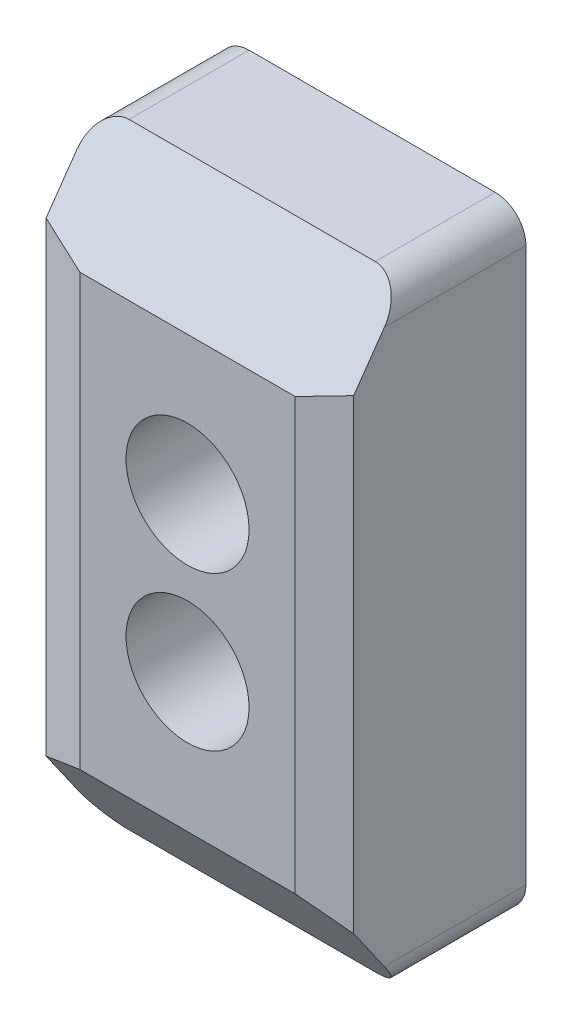
ISO-10303-21;
HEADER;
FILE_DESCRIPTION(('STEP AP214'),'2;1');
FILE_NAME('part.step','',(''),(''),'','','');
FILE_SCHEMA(('AUTOMOTIVE_DESIGN { 1 0 10303 214 1 1 1 1 }'));
ENDSEC;
DATA;
#1=APPLICATION_CONTEXT('core data for automotive mechanical design processes');
#2=APPLICATION_PROTOCOL_DEFINITION('international standard','automotive_design',2000,#1);
#3=PRODUCT_CONTEXT('',#1,'mechanical');
#4=PRODUCT('Part','Part','',(#3));
#5=PRODUCT_RELATED_PRODUCT_CATEGORY('part','',(#4));
#6=PRODUCT_DEFINITION_FORMATION('','',#4);
#7=PRODUCT_DEFINITION_CONTEXT('part definition',#1,'design');
#8=PRODUCT_DEFINITION('design','',#6,#7);
#9=PRODUCT_DEFINITION_SHAPE('','',#8);
#10=(LENGTH_UNIT() NAMED_UNIT(*) SI_UNIT(.MILLI.,.METRE.));
#11=(NAMED_UNIT(*) PLANE_ANGLE_UNIT() SI_UNIT($,.RADIAN.));
#12=(NAMED_UNIT(*) SI_UNIT($,.STERADIAN.) SOLID_ANGLE_UNIT());
#13=UNCERTAINTY_MEASURE_WITH_UNIT(LENGTH_MEASURE(1.E-05),#10,'distance_accuracy_value','');
#14=(GEOMETRIC_REPRESENTATION_CONTEXT(3) GLOBAL_UNCERTAINTY_ASSIGNED_CONTEXT((#13)) GLOBAL_UNIT_ASSIGNED_CONTEXT((#10,
#11,#12)) REPRESENTATION_CONTEXT('',''));
#15=CARTESIAN_POINT('',(0.,0.,0.));
#16=DIRECTION('',(0.,0.,1.));
#17=DIRECTION('',(1.,0.,0.));
#18=AXIS2_PLACEMENT_3D('',#15,#16,#17);
#19=CARTESIAN_POINT('',(0.,0.,12.));
#20=DIRECTION('',(0.,0.,-1.));
#21=DIRECTION('',(-1.,0.,0.));
#22=AXIS2_PLACEMENT_3D('',#19,#20,#21);
#23=PLANE('',#22);
#24=CARTESIAN_POINT('',(0.,5.,12.));
#25=DIRECTION('',(0.,0.,1.));
#26=DIRECTION('',(1.,0.,0.));
#27=AXIS2_PLACEMENT_3D('',#24,#25,#26);
#28=CIRCLE('',#27,4.);
#29=CARTESIAN_POINT('',(4.,5.,12.));
#30=VERTEX_POINT('',#29);
#31=EDGE_CURVE('E253',#30,#30,#28,.T.);
#32=ORIENTED_EDGE('',*,*,#31,.F.);
#33=EDGE_LOOP('',(#32));
#34=FACE_BOUND('',#33,.T.);
#35=CARTESIAN_POINT('',(0.,-5.,12.));
#36=DIRECTION('',(0.,0.,1.));
#37=DIRECTION('',(1.,0.,0.));
#38=AXIS2_PLACEMENT_3D('',#35,#36,#37);
#39=CIRCLE('',#38,4.);
#40=CARTESIAN_POINT('',(4.,-5.,12.));
#41=VERTEX_POINT('',#40);
#42=EDGE_CURVE('E250',#41,#41,#39,.T.);
#43=ORIENTED_EDGE('',*,*,#42,.F.);
#44=EDGE_LOOP('',(#43));
#45=FACE_BOUND('',#44,.T.);
#46=DIRECTION('',(0.,-1.,0.));
#47=VECTOR('',#46,1.);
#48=CARTESIAN_POINT('',(-6.99999999999997,0.,12.));
#49=LINE('',#48,#47);
#50=CARTESIAN_POINT('',(-6.99999999999997,14.,12.));
#51=VERTEX_POINT('',#50);
#52=CARTESIAN_POINT('',(-6.99999999999997,-14.,12.));
#53=VERTEX_POINT('',#52);
#54=EDGE_CURVE('E151',#51,#53,#49,.T.);
#55=ORIENTED_EDGE('',*,*,#54,.T.);
#56=DIRECTION('',(1.,0.,0.));
#57=VECTOR('',#56,1.);
#58=CARTESIAN_POINT('',(0.,-14.,12.));
#59=LINE('',#58,#57);
#60=CARTESIAN_POINT('',(6.99999999999996,-14.,12.));
#61=VERTEX_POINT('',#60);
#62=EDGE_CURVE('E134',#53,#61,#59,.T.);
#63=ORIENTED_EDGE('',*,*,#62,.T.);
#64=DIRECTION('',(0.,1.,0.));
#65=VECTOR('',#64,1.);
#66=CARTESIAN_POINT('',(6.99999999999996,0.,12.));
#67=LINE('',#66,#65);
#68=CARTESIAN_POINT('',(6.99999999999996,14.,12.));
#69=VERTEX_POINT('',#68);
#70=EDGE_CURVE('E148',#61,#69,#67,.T.);
#71=ORIENTED_EDGE('',*,*,#70,.T.);
#72=DIRECTION('',(-1.,0.,0.));
#73=VECTOR('',#72,1.);
#74=CARTESIAN_POINT('',(0.,14.,12.));
#75=LINE('',#74,#73);
#76=EDGE_CURVE('E152',#69,#51,#75,.T.);
#77=ORIENTED_EDGE('',*,*,#76,.T.);
#78=EDGE_LOOP('',(#55,#63,#71,#77));
#79=FACE_BOUND('',#78,.T.);
#80=ADVANCED_FACE('F42',(#34,#45,#79),#23,.F.);
#81=CARTESIAN_POINT('',(0.,0.,0.));
#82=DIRECTION('',(0.,0.,-1.));
#83=DIRECTION('',(-1.,0.,0.));
#84=AXIS2_PLACEMENT_3D('',#81,#82,#83);
#85=PLANE('',#84);
#86=CARTESIAN_POINT('',(0.,-5.,0.));
#87=DIRECTION('',(0.,0.,1.));
#88=DIRECTION('',(1.,0.,0.));
#89=AXIS2_PLACEMENT_3D('',#86,#87,#88);
#90=CIRCLE('',#89,2.15);
#91=CARTESIAN_POINT('',(2.15,-5.,0.));
#92=VERTEX_POINT('',#91);
#93=EDGE_CURVE('E245',#92,#92,#90,.T.);
#94=ORIENTED_EDGE('',*,*,#93,.T.);
#95=EDGE_LOOP('',(#94));
#96=FACE_BOUND('',#95,.T.);
#97=DIRECTION('',(0.,-1.,0.));
#98=VECTOR('',#97,1.);
#99=CARTESIAN_POINT('',(-10.,-20.,0.));
#100=LINE('',#99,#98);
#101=CARTESIAN_POINT('',(-10.,18.,0.));
#102=VERTEX_POINT('',#101);
#103=CARTESIAN_POINT('',(-10.,-18.,0.));
#104=VERTEX_POINT('',#103);
#105=EDGE_CURVE('E237',#102,#104,#100,.T.);
#106=ORIENTED_EDGE('',*,*,#105,.F.);
#107=CARTESIAN_POINT('',(-8.,18.,0.));
#108=DIRECTION('',(0.,0.,-1.));
#109=DIRECTION('',(-1.,0.,0.));
#110=AXIS2_PLACEMENT_3D('',#107,#108,#109);
#111=CIRCLE('',#110,2.);
#112=CARTESIAN_POINT('',(-8.,20.,0.));
#113=VERTEX_POINT('',#112);
#114=EDGE_CURVE('E203',#102,#113,#111,.T.);
#115=ORIENTED_EDGE('',*,*,#114,.T.);
#116=DIRECTION('',(-1.,0.,0.));
#117=VECTOR('',#116,1.);
#118=CARTESIAN_POINT('',(-10.,20.,0.));
#119=LINE('',#118,#117);
#120=CARTESIAN_POINT('',(8.,20.,0.));
#121=VERTEX_POINT('',#120);
#122=EDGE_CURVE('E239',#121,#113,#119,.T.);
#123=ORIENTED_EDGE('',*,*,#122,.F.);
#124=CARTESIAN_POINT('',(8.,18.,0.));
#125=DIRECTION('',(0.,0.,-1.));
#126=DIRECTION('',(-1.,0.,0.));
#127=AXIS2_PLACEMENT_3D('',#124,#125,#126);
#128=CIRCLE('',#127,2.);
#129=CARTESIAN_POINT('',(10.,18.,0.));
#130=VERTEX_POINT('',#129);
#131=EDGE_CURVE('E201',#121,#130,#128,.T.);
#132=ORIENTED_EDGE('',*,*,#131,.T.);
#133=DIRECTION('',(0.,1.,0.));
#134=VECTOR('',#133,1.);
#135=CARTESIAN_POINT('',(10.,-20.,0.));
#136=LINE('',#135,#134);
#137=CARTESIAN_POINT('',(10.,-18.,0.));
#138=VERTEX_POINT('',#137);
#139=EDGE_CURVE('E234',#138,#130,#136,.T.);
#140=ORIENTED_EDGE('',*,*,#139,.F.);
#141=CARTESIAN_POINT('',(8.,-18.,0.));
#142=DIRECTION('',(0.,0.,-1.));
#143=DIRECTION('',(-1.,0.,0.));
#144=AXIS2_PLACEMENT_3D('',#141,#142,#143);
#145=CIRCLE('',#144,2.);
#146=CARTESIAN_POINT('',(8.,-20.,0.));
#147=VERTEX_POINT('',#146);
#148=EDGE_CURVE('E197',#138,#147,#145,.T.);
#149=ORIENTED_EDGE('',*,*,#148,.T.);
#150=DIRECTION('',(1.,0.,0.));
#151=VECTOR('',#150,1.);
#152=CARTESIAN_POINT('',(-10.,-20.,0.));
#153=LINE('',#152,#151);
#154=CARTESIAN_POINT('',(-8.,-20.,0.));
#155=VERTEX_POINT('',#154);
#156=EDGE_CURVE('E160',#155,#147,#153,.T.);
#157=ORIENTED_EDGE('',*,*,#156,.F.);
#158=CARTESIAN_POINT('',(-8.,-18.,0.));
#159=DIRECTION('',(0.,0.,-1.));
#160=DIRECTION('',(-1.,0.,0.));
#161=AXIS2_PLACEMENT_3D('',#158,#159,#160);
#162=CIRCLE('',#161,2.);
#163=EDGE_CURVE('E199',#155,#104,#162,.T.);
#164=ORIENTED_EDGE('',*,*,#163,.T.);
#165=EDGE_LOOP('',(#106,#115,#123,#132,#140,#149,#157,#164));
#166=FACE_BOUND('',#165,.T.);
#167=CARTESIAN_POINT('',(0.,5.,0.));
#168=DIRECTION('',(0.,0.,1.));
#169=DIRECTION('',(1.,0.,0.));
#170=AXIS2_PLACEMENT_3D('',#167,#168,#169);
#171=CIRCLE('',#170,2.15);
#172=CARTESIAN_POINT('',(2.15,5.,0.));
#173=VERTEX_POINT('',#172);
#174=EDGE_CURVE('E192',#173,#173,#171,.T.);
#175=ORIENTED_EDGE('',*,*,#174,.T.);
#176=EDGE_LOOP('',(#175));
#177=FACE_BOUND('',#176,.T.);
#178=ADVANCED_FACE('F232',(#96,#166,#177),#85,.T.);
#179=CARTESIAN_POINT('',(10.,-20.,12.));
#180=DIRECTION('',(-1.,0.,0.));
#181=DIRECTION('',(0.,0.,1.));
#182=AXIS2_PLACEMENT_3D('',#179,#180,#181);
#183=PLANE('',#182);
#184=ORIENTED_EDGE('',*,*,#139,.T.);
#185=DIRECTION('',(0.,0.,-1.));
#186=VECTOR('',#185,1.);
#187=CARTESIAN_POINT('',(10.,18.,12.));
#188=LINE('',#187,#186);
#189=CARTESIAN_POINT('',(10.,18.,9.19916984716115));
#190=VERTEX_POINT('',#189);
#191=EDGE_CURVE('E217',#130,#190,#188,.F.);
#192=ORIENTED_EDGE('',*,*,#191,.T.);
#193=DIRECTION('',(0.,0.819152044288993,-0.573576436351044));
#194=VECTOR('',#193,1.);
#195=CARTESIAN_POINT('',(10.,14.,12.));
#196=LINE('',#195,#194);
#197=CARTESIAN_POINT('',(10.,15.148013315236,11.1961524227066));
#198=VERTEX_POINT('',#197);
#199=EDGE_CURVE('E141',#190,#198,#196,.F.);
#200=ORIENTED_EDGE('',*,*,#199,.T.);
#201=DIRECTION('',(0.,-1.,0.));
#202=VECTOR('',#201,1.);
#203=CARTESIAN_POINT('',(10.,-20.,11.1961524227066));
#204=LINE('',#203,#202);
#205=CARTESIAN_POINT('',(10.,-15.148013315236,11.1961524227066));
#206=VERTEX_POINT('',#205);
#207=EDGE_CURVE('E156',#198,#206,#204,.T.);
#208=ORIENTED_EDGE('',*,*,#207,.T.);
#209=DIRECTION('',(0.,0.819152044288993,0.573576436351044));
#210=VECTOR('',#209,1.);
#211=CARTESIAN_POINT('',(10.,-14.,12.));
#212=LINE('',#211,#210);
#213=CARTESIAN_POINT('',(10.,-18.,9.19916984716115));
#214=VERTEX_POINT('',#213);
#215=EDGE_CURVE('E136',#206,#214,#212,.F.);
#216=ORIENTED_EDGE('',*,*,#215,.T.);
#217=DIRECTION('',(0.,0.,-1.));
#218=VECTOR('',#217,1.);
#219=CARTESIAN_POINT('',(10.,-18.,12.));
#220=LINE('',#219,#218);
#221=EDGE_CURVE('E214',#214,#138,#220,.T.);
#222=ORIENTED_EDGE('',*,*,#221,.T.);
#223=EDGE_LOOP('',(#184,#192,#200,#208,#216,#222));
#224=FACE_BOUND('',#223,.T.);
#225=ADVANCED_FACE('F227',(#224),#183,.F.);
#226=CARTESIAN_POINT('',(-10.,20.,12.));
#227=DIRECTION('',(0.,-1.,0.));
#228=DIRECTION('',(0.,0.,-1.));
#229=AXIS2_PLACEMENT_3D('',#226,#227,#228);
#230=PLANE('',#229);
#231=ORIENTED_EDGE('',*,*,#122,.T.);
#232=DIRECTION('',(0.,0.,-1.));
#233=VECTOR('',#232,1.);
#234=CARTESIAN_POINT('',(-8.,20.,12.));
#235=LINE('',#234,#233);
#236=CARTESIAN_POINT('',(-8.,20.,7.79875477074174));
#237=VERTEX_POINT('',#236);
#238=EDGE_CURVE('E208',#113,#237,#235,.F.);
#239=ORIENTED_EDGE('',*,*,#238,.T.);
#240=DIRECTION('',(1.,0.,0.));
#241=VECTOR('',#240,1.);
#242=CARTESIAN_POINT('',(-10.,20.,7.79875477074174));
#243=LINE('',#242,#241);
#244=CARTESIAN_POINT('',(8.,20.,7.79875477074174));
#245=VERTEX_POINT('',#244);
#246=EDGE_CURVE('E181',#237,#245,#243,.T.);
#247=ORIENTED_EDGE('',*,*,#246,.T.);
#248=DIRECTION('',(0.,0.,-1.));
#249=VECTOR('',#248,1.);
#250=CARTESIAN_POINT('',(8.,20.,12.));
#251=LINE('',#250,#249);
#252=EDGE_CURVE('E205',#245,#121,#251,.T.);
#253=ORIENTED_EDGE('',*,*,#252,.T.);
#254=EDGE_LOOP('',(#231,#239,#247,#253));
#255=FACE_BOUND('',#254,.T.);
#256=ADVANCED_FACE('F304',(#255),#230,.F.);
#257=CARTESIAN_POINT('',(-10.,-20.,12.));
#258=DIRECTION('',(1.,0.,0.));
#259=DIRECTION('',(0.,0.,-1.));
#260=AXIS2_PLACEMENT_3D('',#257,#258,#259);
#261=PLANE('',#260);
#262=DIRECTION('',(0.,-0.819152044288993,0.573576436351044));
#263=VECTOR('',#262,1.);
#264=CARTESIAN_POINT('',(-10.,14.,12.));
#265=LINE('',#264,#263);
#266=CARTESIAN_POINT('',(-10.,15.148013315236,11.1961524227066));
#267=VERTEX_POINT('',#266);
#268=CARTESIAN_POINT('',(-10.,18.,9.19916984716115));
#269=VERTEX_POINT('',#268);
#270=EDGE_CURVE('E172',#267,#269,#265,.F.);
#271=ORIENTED_EDGE('',*,*,#270,.T.);
#272=DIRECTION('',(0.,0.,-1.));
#273=VECTOR('',#272,1.);
#274=CARTESIAN_POINT('',(-10.,18.,12.));
#275=LINE('',#274,#273);
#276=EDGE_CURVE('E194',#269,#102,#275,.T.);
#277=ORIENTED_EDGE('',*,*,#276,.T.);
#278=ORIENTED_EDGE('',*,*,#105,.T.);
#279=DIRECTION('',(0.,0.,-1.));
#280=VECTOR('',#279,1.);
#281=CARTESIAN_POINT('',(-10.,-18.,12.));
#282=LINE('',#281,#280);
#283=CARTESIAN_POINT('',(-10.,-18.,9.19916984716115));
#284=VERTEX_POINT('',#283);
#285=EDGE_CURVE('E184',#104,#284,#282,.F.);
#286=ORIENTED_EDGE('',*,*,#285,.T.);
#287=DIRECTION('',(0.,-0.819152044288993,-0.573576436351044));
#288=VECTOR('',#287,1.);
#289=CARTESIAN_POINT('',(-10.,-14.,12.));
#290=LINE('',#289,#288);
#291=CARTESIAN_POINT('',(-10.,-15.148013315236,11.1961524227066));
#292=VERTEX_POINT('',#291);
#293=EDGE_CURVE('E175',#284,#292,#290,.F.);
#294=ORIENTED_EDGE('',*,*,#293,.T.);
#295=DIRECTION('',(0.,1.,0.));
#296=VECTOR('',#295,1.);
#297=CARTESIAN_POINT('',(-10.,-20.,11.1961524227066));
#298=LINE('',#297,#296);
#299=EDGE_CURVE('E158',#292,#267,#298,.T.);
#300=ORIENTED_EDGE('',*,*,#299,.T.);
#301=EDGE_LOOP('',(#271,#277,#278,#286,#294,#300));
#302=FACE_BOUND('',#301,.T.);
#303=ADVANCED_FACE('F301',(#302),#261,.F.);
#304=CARTESIAN_POINT('',(-10.,-20.,12.));
#305=DIRECTION('',(0.,1.,0.));
#306=DIRECTION('',(0.,0.,1.));
#307=AXIS2_PLACEMENT_3D('',#304,#305,#306);
#308=PLANE('',#307);
#309=DIRECTION('',(-1.,0.,0.));
#310=VECTOR('',#309,1.);
#311=CARTESIAN_POINT('',(-10.,-20.,7.79875477074174));
#312=LINE('',#311,#310);
#313=CARTESIAN_POINT('',(8.,-20.,7.79875477074174));
#314=VERTEX_POINT('',#313);
#315=CARTESIAN_POINT('',(-8.,-20.,7.79875477074174));
#316=VERTEX_POINT('',#315);
#317=EDGE_CURVE('E170',#314,#316,#312,.T.);
#318=ORIENTED_EDGE('',*,*,#317,.T.);
#319=DIRECTION('',(0.,0.,-1.));
#320=VECTOR('',#319,1.);
#321=CARTESIAN_POINT('',(-8.,-20.,12.));
#322=LINE('',#321,#320);
#323=EDGE_CURVE('E220',#316,#155,#322,.T.);
#324=ORIENTED_EDGE('',*,*,#323,.T.);
#325=ORIENTED_EDGE('',*,*,#156,.T.);
#326=DIRECTION('',(0.,0.,-1.));
#327=VECTOR('',#326,1.);
#328=CARTESIAN_POINT('',(8.,-20.,12.));
#329=LINE('',#328,#327);
#330=EDGE_CURVE('E62',#147,#314,#329,.F.);
#331=ORIENTED_EDGE('',*,*,#330,.T.);
#332=EDGE_LOOP('',(#318,#324,#325,#331));
#333=FACE_BOUND('',#332,.T.);
#334=ADVANCED_FACE('F235',(#333),#308,.F.);
#335=CARTESIAN_POINT('',(0.,-5.,12.));
#336=DIRECTION('',(0.,0.,-1.));
#337=DIRECTION('',(-1.,0.,0.));
#338=AXIS2_PLACEMENT_3D('',#335,#336,#337);
#339=CYLINDRICAL_SURFACE('',#338,2.15);
#340=CARTESIAN_POINT('',(0.,-5.,1.));
#341=DIRECTION('',(0.,0.,-1.));
#342=DIRECTION('',(-1.,0.,0.));
#343=AXIS2_PLACEMENT_3D('',#340,#341,#342);
#344=CIRCLE('',#343,2.15);
#345=CARTESIAN_POINT('',(-2.15,-5.,1.));
#346=VERTEX_POINT('',#345);
#347=EDGE_CURVE('E188',#346,#346,#344,.T.);
#348=ORIENTED_EDGE('',*,*,#347,.F.);
#349=EDGE_LOOP('',(#348));
#350=FACE_BOUND('',#349,.T.);
#351=ORIENTED_EDGE('',*,*,#93,.F.);
#352=EDGE_LOOP('',(#351));
#353=FACE_BOUND('',#352,.T.);
#354=ADVANCED_FACE('F291',(#350,#353),#339,.F.);
#355=CARTESIAN_POINT('',(0.,5.,12.));
#356=DIRECTION('',(0.,0.,-1.));
#357=DIRECTION('',(-1.,0.,0.));
#358=AXIS2_PLACEMENT_3D('',#355,#356,#357);
#359=CYLINDRICAL_SURFACE('',#358,2.15);
#360=CARTESIAN_POINT('',(0.,5.,1.));
#361=DIRECTION('',(0.,0.,-1.));
#362=DIRECTION('',(-1.,0.,0.));
#363=AXIS2_PLACEMENT_3D('',#360,#361,#362);
#364=CIRCLE('',#363,2.15);
#365=CARTESIAN_POINT('',(-2.15,5.,1.));
#366=VERTEX_POINT('',#365);
#367=EDGE_CURVE('E185',#366,#366,#364,.T.);
#368=ORIENTED_EDGE('',*,*,#367,.F.);
#369=EDGE_LOOP('',(#368));
#370=FACE_BOUND('',#369,.T.);
#371=ORIENTED_EDGE('',*,*,#174,.F.);
#372=EDGE_LOOP('',(#371));
#373=FACE_BOUND('',#372,.T.);
#374=ADVANCED_FACE('F288',(#370,#373),#359,.F.);
#375=CARTESIAN_POINT('',(6.99999999999996,0.,12.));
#376=DIRECTION('',(-0.258819045102518,0.,-0.965925826289069));
#377=DIRECTION('',(0.,1.,0.));
#378=AXIS2_PLACEMENT_3D('',#375,#376,#377);
#379=PLANE('',#378);
#380=ORIENTED_EDGE('',*,*,#70,.F.);
#381=DIRECTION('',(0.906013464377679,-0.346705173629555,-0.24276557611172));
#382=VECTOR('',#381,1.);
#383=CARTESIAN_POINT('',(2.60232622331107,-12.317137316099,13.1783531370393));
#384=LINE('',#383,#382);
#385=EDGE_CURVE('E130',#61,#206,#384,.T.);
#386=ORIENTED_EDGE('',*,*,#385,.T.);
#387=ORIENTED_EDGE('',*,*,#207,.F.);
#388=DIRECTION('',(-0.906013464377679,-0.346705173629555,0.24276557611172));
#389=VECTOR('',#388,1.);
#390=CARTESIAN_POINT('',(2.60232622331107,12.317137316099,13.1783531370393));
#391=LINE('',#390,#389);
#392=EDGE_CURVE('E142',#198,#69,#391,.T.);
#393=ORIENTED_EDGE('',*,*,#392,.T.);
#394=EDGE_LOOP('',(#380,#386,#387,#393));
#395=FACE_BOUND('',#394,.T.);
#396=ADVANCED_FACE('F154',(#395),#379,.F.);
#397=CARTESIAN_POINT('',(-6.99999999999997,0.,12.));
#398=DIRECTION('',(0.258819045102518,0.,-0.965925826289069));
#399=DIRECTION('',(0.,-1.,0.));
#400=AXIS2_PLACEMENT_3D('',#397,#398,#399);
#401=PLANE('',#400);
#402=ORIENTED_EDGE('',*,*,#299,.F.);
#403=DIRECTION('',(0.906013464377679,0.346705173629555,0.24276557611172));
#404=VECTOR('',#403,1.);
#405=CARTESIAN_POINT('',(-2.60232622331108,-12.317137316099,13.1783531370393));
#406=LINE('',#405,#404);
#407=EDGE_CURVE('E179',#292,#53,#406,.T.);
#408=ORIENTED_EDGE('',*,*,#407,.T.);
#409=ORIENTED_EDGE('',*,*,#54,.F.);
#410=DIRECTION('',(-0.906013464377679,0.346705173629555,-0.24276557611172));
#411=VECTOR('',#410,1.);
#412=CARTESIAN_POINT('',(-2.60232622331108,12.317137316099,13.1783531370393));
#413=LINE('',#412,#411);
#414=EDGE_CURVE('E177',#51,#267,#413,.T.);
#415=ORIENTED_EDGE('',*,*,#414,.T.);
#416=EDGE_LOOP('',(#402,#408,#409,#415));
#417=FACE_BOUND('',#416,.T.);
#418=ADVANCED_FACE('F317',(#417),#401,.F.);
#419=CARTESIAN_POINT('',(0.,-14.,12.));
#420=DIRECTION('',(0.,0.573576436351044,-0.819152044288993));
#421=DIRECTION('',(1.,0.,0.));
#422=AXIS2_PLACEMENT_3D('',#419,#420,#421);
#423=PLANE('',#422);
#424=ORIENTED_EDGE('',*,*,#293,.F.);
#425=CARTESIAN_POINT('',(-8.,-18.,9.19916984716115));
#426=DIRECTION('',(0.,0.573576436351044,-0.819152044288993));
#427=DIRECTION('',(0.,-0.819152044288993,-0.573576436351044));
#428=AXIS2_PLACEMENT_3D('',#425,#426,#427);
#429=ELLIPSE('',#428,2.44154917752291,2.);
#430=EDGE_CURVE('E12',#284,#316,#429,.F.);
#431=ORIENTED_EDGE('',*,*,#430,.T.);
#432=ORIENTED_EDGE('',*,*,#317,.F.);
#433=CARTESIAN_POINT('',(8.,-18.,9.19916984716115));
#434=DIRECTION('',(0.,0.573576436351044,-0.819152044288993));
#435=DIRECTION('',(0.,-0.819152044288993,-0.573576436351044));
#436=AXIS2_PLACEMENT_3D('',#433,#434,#435);
#437=ELLIPSE('',#436,2.44154917752291,2.);
#438=EDGE_CURVE('E50',#314,#214,#437,.F.);
#439=ORIENTED_EDGE('',*,*,#438,.T.);
#440=ORIENTED_EDGE('',*,*,#215,.F.);
#441=ORIENTED_EDGE('',*,*,#385,.F.);
#442=ORIENTED_EDGE('',*,*,#62,.F.);
#443=ORIENTED_EDGE('',*,*,#407,.F.);
#444=EDGE_LOOP('',(#424,#431,#432,#439,#440,#441,#442,#443));
#445=FACE_BOUND('',#444,.T.);
#446=ADVANCED_FACE('F132',(#445),#423,.F.);
#447=CARTESIAN_POINT('',(0.,14.,12.));
#448=DIRECTION('',(0.,-0.573576436351044,-0.819152044288993));
#449=DIRECTION('',(-1.,0.,0.));
#450=AXIS2_PLACEMENT_3D('',#447,#448,#449);
#451=PLANE('',#450);
#452=ORIENTED_EDGE('',*,*,#246,.F.);
#453=CARTESIAN_POINT('',(-8.,18.,9.19916984716115));
#454=DIRECTION('',(0.,-0.573576436351044,-0.819152044288993));
#455=DIRECTION('',(0.,0.819152044288993,-0.573576436351044));
#456=AXIS2_PLACEMENT_3D('',#453,#454,#455);
#457=ELLIPSE('',#456,2.44154917752291,2.);
#458=EDGE_CURVE('E212',#237,#269,#457,.F.);
#459=ORIENTED_EDGE('',*,*,#458,.T.);
#460=ORIENTED_EDGE('',*,*,#270,.F.);
#461=ORIENTED_EDGE('',*,*,#414,.F.);
#462=ORIENTED_EDGE('',*,*,#76,.F.);
#463=ORIENTED_EDGE('',*,*,#392,.F.);
#464=ORIENTED_EDGE('',*,*,#199,.F.);
#465=CARTESIAN_POINT('',(8.,18.,9.19916984716115));
#466=DIRECTION('',(0.,-0.573576436351044,-0.819152044288993));
#467=DIRECTION('',(0.,0.819152044288993,-0.573576436351044));
#468=AXIS2_PLACEMENT_3D('',#465,#466,#467);
#469=ELLIPSE('',#468,2.44154917752291,2.);
#470=EDGE_CURVE('E210',#190,#245,#469,.F.);
#471=ORIENTED_EDGE('',*,*,#470,.T.);
#472=EDGE_LOOP('',(#452,#459,#460,#461,#462,#463,#464,#471));
#473=FACE_BOUND('',#472,.T.);
#474=ADVANCED_FACE('F329',(#473),#451,.F.);
#475=CARTESIAN_POINT('',(0.,0.,1.));
#476=DIRECTION('',(0.,0.,-1.));
#477=DIRECTION('',(-1.,0.,0.));
#478=AXIS2_PLACEMENT_3D('',#475,#476,#477);
#479=PLANE('',#478);
#480=ORIENTED_EDGE('',*,*,#367,.T.);
#481=EDGE_LOOP('',(#480));
#482=FACE_BOUND('',#481,.T.);
#483=CARTESIAN_POINT('',(0.,5.,1.));
#484=DIRECTION('',(0.,0.,-1.));
#485=DIRECTION('',(-1.,0.,0.));
#486=AXIS2_PLACEMENT_3D('',#483,#484,#485);
#487=CIRCLE('',#486,4.);
#488=CARTESIAN_POINT('',(-4.,5.,1.));
#489=VERTEX_POINT('',#488);
#490=EDGE_CURVE('E189',#489,#489,#487,.F.);
#491=ORIENTED_EDGE('',*,*,#490,.T.);
#492=EDGE_LOOP('',(#491));
#493=FACE_BOUND('',#492,.T.);
#494=ADVANCED_FACE('F284',(#482,#493),#479,.F.);
#495=CARTESIAN_POINT('',(0.,5.,-11.3137084989848));
#496=DIRECTION('',(0.,0.,1.));
#497=DIRECTION('',(1.,0.,0.));
#498=AXIS2_PLACEMENT_3D('',#495,#496,#497);
#499=CYLINDRICAL_SURFACE('',#498,4.);
#500=ORIENTED_EDGE('',*,*,#31,.T.);
#501=EDGE_LOOP('',(#500));
#502=FACE_BOUND('',#501,.T.);
#503=ORIENTED_EDGE('',*,*,#490,.F.);
#504=EDGE_LOOP('',(#503));
#505=FACE_BOUND('',#504,.T.);
#506=ADVANCED_FACE('F262',(#502,#505),#499,.F.);
#507=CARTESIAN_POINT('',(0.,0.,1.));
#508=DIRECTION('',(0.,0.,-1.));
#509=DIRECTION('',(-1.,0.,0.));
#510=AXIS2_PLACEMENT_3D('',#507,#508,#509);
#511=PLANE('',#510);
#512=ORIENTED_EDGE('',*,*,#347,.T.);
#513=EDGE_LOOP('',(#512));
#514=FACE_BOUND('',#513,.T.);
#515=CARTESIAN_POINT('',(0.,-5.,1.));
#516=DIRECTION('',(0.,0.,-1.));
#517=DIRECTION('',(-1.,0.,0.));
#518=AXIS2_PLACEMENT_3D('',#515,#516,#517);
#519=CIRCLE('',#518,4.);
#520=CARTESIAN_POINT('',(-4.,-5.,1.));
#521=VERTEX_POINT('',#520);
#522=EDGE_CURVE('E254',#521,#521,#519,.F.);
#523=ORIENTED_EDGE('',*,*,#522,.T.);
#524=EDGE_LOOP('',(#523));
#525=FACE_BOUND('',#524,.T.);
#526=ADVANCED_FACE('F274',(#514,#525),#511,.F.);
#527=CARTESIAN_POINT('',(0.,-5.,-11.3137084989848));
#528=DIRECTION('',(0.,0.,1.));
#529=DIRECTION('',(1.,0.,0.));
#530=AXIS2_PLACEMENT_3D('',#527,#528,#529);
#531=CYLINDRICAL_SURFACE('',#530,4.);
#532=ORIENTED_EDGE('',*,*,#42,.T.);
#533=EDGE_LOOP('',(#532));
#534=FACE_BOUND('',#533,.T.);
#535=ORIENTED_EDGE('',*,*,#522,.F.);
#536=EDGE_LOOP('',(#535));
#537=FACE_BOUND('',#536,.T.);
#538=ADVANCED_FACE('F270',(#534,#537),#531,.F.);
#539=CARTESIAN_POINT('',(-8.,18.,12.));
#540=DIRECTION('',(0.,0.,-1.));
#541=DIRECTION('',(-1.,0.,0.));
#542=AXIS2_PLACEMENT_3D('',#539,#540,#541);
#543=CYLINDRICAL_SURFACE('',#542,2.);
#544=ORIENTED_EDGE('',*,*,#458,.F.);
#545=ORIENTED_EDGE('',*,*,#238,.F.);
#546=ORIENTED_EDGE('',*,*,#114,.F.);
#547=ORIENTED_EDGE('',*,*,#276,.F.);
#548=EDGE_LOOP('',(#544,#545,#546,#547));
#549=FACE_BOUND('',#548,.T.);
#550=ADVANCED_FACE('F273',(#549),#543,.T.);
#551=CARTESIAN_POINT('',(8.,18.,12.));
#552=DIRECTION('',(0.,0.,-1.));
#553=DIRECTION('',(-1.,0.,0.));
#554=AXIS2_PLACEMENT_3D('',#551,#552,#553);
#555=CYLINDRICAL_SURFACE('',#554,2.);
#556=ORIENTED_EDGE('',*,*,#470,.F.);
#557=ORIENTED_EDGE('',*,*,#191,.F.);
#558=ORIENTED_EDGE('',*,*,#131,.F.);
#559=ORIENTED_EDGE('',*,*,#252,.F.);
#560=EDGE_LOOP('',(#556,#557,#558,#559));
#561=FACE_BOUND('',#560,.T.);
#562=ADVANCED_FACE('F337',(#561),#555,.T.);
#563=CARTESIAN_POINT('',(-8.,-18.,12.));
#564=DIRECTION('',(0.,0.,-1.));
#565=DIRECTION('',(-1.,0.,0.));
#566=AXIS2_PLACEMENT_3D('',#563,#564,#565);
#567=CYLINDRICAL_SURFACE('',#566,2.);
#568=ORIENTED_EDGE('',*,*,#430,.F.);
#569=ORIENTED_EDGE('',*,*,#285,.F.);
#570=ORIENTED_EDGE('',*,*,#163,.F.);
#571=ORIENTED_EDGE('',*,*,#323,.F.);
#572=EDGE_LOOP('',(#568,#569,#570,#571));
#573=FACE_BOUND('',#572,.T.);
#574=ADVANCED_FACE('F340',(#573),#567,.T.);
#575=CARTESIAN_POINT('',(8.,-18.,12.));
#576=DIRECTION('',(0.,0.,-1.));
#577=DIRECTION('',(-1.,0.,0.));
#578=AXIS2_PLACEMENT_3D('',#575,#576,#577);
#579=CYLINDRICAL_SURFACE('',#578,2.);
#580=ORIENTED_EDGE('',*,*,#438,.F.);
#581=ORIENTED_EDGE('',*,*,#330,.F.);
#582=ORIENTED_EDGE('',*,*,#148,.F.);
#583=ORIENTED_EDGE('',*,*,#221,.F.);
#584=EDGE_LOOP('',(#580,#581,#582,#583));
#585=FACE_BOUND('',#584,.T.);
#586=ADVANCED_FACE('F44',(#585),#579,.T.);
#587=CLOSED_SHELL('',(#80,#178,#225,#256,#303,#334,#354,#374,#396,#418,#446,#474,#494,#506,#526,
#538,#550,#562,#574,#586));
#588=MANIFOLD_SOLID_BREP('B2',#587);
#589=ADVANCED_BREP_SHAPE_REPRESENTATION('',(#18,#588),#14);
#590=SHAPE_DEFINITION_REPRESENTATION(#9,#589);
ENDSEC;
END-ISO-10303-21;
